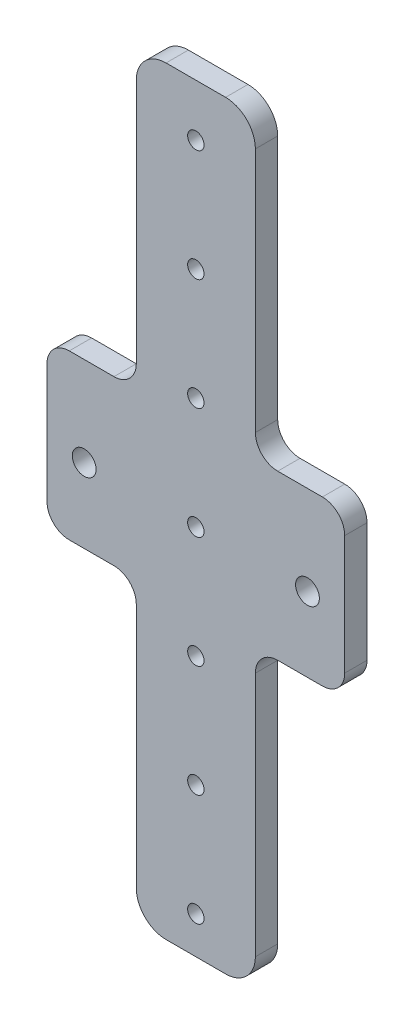
ISO-10303-21;
HEADER;
FILE_DESCRIPTION(('STEP AP214'),'2;1');
FILE_NAME('part.step','',(''),(''),'','','');
FILE_SCHEMA(('AUTOMOTIVE_DESIGN { 1 0 10303 214 1 1 1 1 }'));
ENDSEC;
DATA;
#1=APPLICATION_CONTEXT('core data for automotive mechanical design processes');
#2=APPLICATION_PROTOCOL_DEFINITION('international standard','automotive_design',2000,#1);
#3=PRODUCT_CONTEXT('',#1,'mechanical');
#4=PRODUCT('Part','Part','',(#3));
#5=PRODUCT_RELATED_PRODUCT_CATEGORY('part','',(#4));
#6=PRODUCT_DEFINITION_FORMATION('','',#4);
#7=PRODUCT_DEFINITION_CONTEXT('part definition',#1,'design');
#8=PRODUCT_DEFINITION('design','',#6,#7);
#9=PRODUCT_DEFINITION_SHAPE('','',#8);
#10=(LENGTH_UNIT() NAMED_UNIT(*) SI_UNIT(.MILLI.,.METRE.));
#11=(NAMED_UNIT(*) PLANE_ANGLE_UNIT() SI_UNIT($,.RADIAN.));
#12=(NAMED_UNIT(*) SI_UNIT($,.STERADIAN.) SOLID_ANGLE_UNIT());
#13=UNCERTAINTY_MEASURE_WITH_UNIT(LENGTH_MEASURE(1.E-05),#10,'distance_accuracy_value','');
#14=(GEOMETRIC_REPRESENTATION_CONTEXT(3) GLOBAL_UNCERTAINTY_ASSIGNED_CONTEXT((#13)) GLOBAL_UNIT_ASSIGNED_CONTEXT((#10,
#11,#12)) REPRESENTATION_CONTEXT('',''));
#15=CARTESIAN_POINT('',(0.,0.,0.));
#16=DIRECTION('',(0.,0.,1.));
#17=DIRECTION('',(1.,0.,0.));
#18=AXIS2_PLACEMENT_3D('',#15,#16,#17);
#19=CARTESIAN_POINT('',(0.,0.,3.));
#20=DIRECTION('',(0.,0.,-1.));
#21=DIRECTION('',(-1.,0.,0.));
#22=AXIS2_PLACEMENT_3D('',#19,#20,#21);
#23=PLANE('',#22);
#24=CARTESIAN_POINT('',(0.,15.,3.));
#25=DIRECTION('',(0.,0.,1.));
#26=DIRECTION('',(1.,0.,0.));
#27=AXIS2_PLACEMENT_3D('',#24,#25,#26);
#28=CIRCLE('',#27,1.1);
#29=CARTESIAN_POINT('',(1.09999999999995,15.,3.));
#30=VERTEX_POINT('',#29);
#31=EDGE_CURVE('E408',#30,#30,#28,.T.);
#32=ORIENTED_EDGE('',*,*,#31,.F.);
#33=EDGE_LOOP('',(#32));
#34=FACE_BOUND('',#33,.T.);
#35=CARTESIAN_POINT('',(0.,-15.,3.));
#36=DIRECTION('',(0.,0.,1.));
#37=DIRECTION('',(1.,0.,0.));
#38=AXIS2_PLACEMENT_3D('',#35,#36,#37);
#39=CIRCLE('',#38,1.1000000000002);
#40=CARTESIAN_POINT('',(1.10000000000025,-15.,3.));
#41=VERTEX_POINT('',#40);
#42=EDGE_CURVE('E402',#41,#41,#39,.T.);
#43=ORIENTED_EDGE('',*,*,#42,.F.);
#44=EDGE_LOOP('',(#43));
#45=FACE_BOUND('',#44,.T.);
#46=CARTESIAN_POINT('',(-1.04744440165294E-13,30.,3.));
#47=DIRECTION('',(0.,0.,1.));
#48=DIRECTION('',(1.,0.,0.));
#49=AXIS2_PLACEMENT_3D('',#46,#47,#48);
#50=CIRCLE('',#49,1.1);
#51=CARTESIAN_POINT('',(1.0999999999999,30.,3.));
#52=VERTEX_POINT('',#51);
#53=EDGE_CURVE('E396',#52,#52,#50,.T.);
#54=ORIENTED_EDGE('',*,*,#53,.F.);
#55=EDGE_LOOP('',(#54));
#56=FACE_BOUND('',#55,.T.);
#57=CARTESIAN_POINT('',(-1.57116660247941E-13,45.,3.));
#58=DIRECTION('',(0.,0.,1.));
#59=DIRECTION('',(1.,0.,0.));
#60=AXIS2_PLACEMENT_3D('',#57,#58,#59);
#61=CIRCLE('',#60,1.1);
#62=CARTESIAN_POINT('',(1.09999999999984,45.,3.));
#63=VERTEX_POINT('',#62);
#64=EDGE_CURVE('E389',#63,#63,#61,.T.);
#65=ORIENTED_EDGE('',*,*,#64,.F.);
#66=EDGE_LOOP('',(#65));
#67=FACE_BOUND('',#66,.T.);
#68=CARTESIAN_POINT('',(0.,0.,3.));
#69=DIRECTION('',(0.,0.,1.));
#70=DIRECTION('',(1.,0.,0.));
#71=AXIS2_PLACEMENT_3D('',#68,#69,#70);
#72=CIRCLE('',#71,1.1);
#73=CARTESIAN_POINT('',(1.1,0.,3.));
#74=VERTEX_POINT('',#73);
#75=EDGE_CURVE('E426',#74,#74,#72,.T.);
#76=ORIENTED_EDGE('',*,*,#75,.F.);
#77=EDGE_LOOP('',(#76));
#78=FACE_BOUND('',#77,.T.);
#79=CARTESIAN_POINT('',(4.18977760661176E-13,-30.,3.));
#80=DIRECTION('',(0.,0.,1.));
#81=DIRECTION('',(1.,0.,0.));
#82=AXIS2_PLACEMENT_3D('',#79,#80,#81);
#83=CIRCLE('',#82,1.1);
#84=CARTESIAN_POINT('',(1.10000000000042,-30.,3.));
#85=VERTEX_POINT('',#84);
#86=EDGE_CURVE('E420',#85,#85,#83,.T.);
#87=ORIENTED_EDGE('',*,*,#86,.F.);
#88=EDGE_LOOP('',(#87));
#89=FACE_BOUND('',#88,.T.);
#90=CARTESIAN_POINT('',(5.76094420909117E-13,-45.,3.));
#91=DIRECTION('',(0.,0.,1.));
#92=DIRECTION('',(1.,0.,0.));
#93=AXIS2_PLACEMENT_3D('',#90,#91,#92);
#94=CIRCLE('',#93,1.1);
#95=CARTESIAN_POINT('',(1.10000000000058,-45.,3.));
#96=VERTEX_POINT('',#95);
#97=EDGE_CURVE('E413',#96,#96,#94,.T.);
#98=ORIENTED_EDGE('',*,*,#97,.F.);
#99=EDGE_LOOP('',(#98));
#100=FACE_BOUND('',#99,.T.);
#101=DIRECTION('',(0.,1.,0.));
#102=VECTOR('',#101,1.);
#103=CARTESIAN_POINT('',(-8.,-10.,3.));
#104=LINE('',#103,#102);
#105=CARTESIAN_POINT('',(-8.,-46.,3.));
#106=VERTEX_POINT('',#105);
#107=CARTESIAN_POINT('',(-8.,-13.,3.));
#108=VERTEX_POINT('',#107);
#109=EDGE_CURVE('E469',#106,#108,#104,.T.);
#110=ORIENTED_EDGE('',*,*,#109,.F.);
#111=CARTESIAN_POINT('',(-4.,-46.,3.));
#112=DIRECTION('',(0.,0.,-1.));
#113=DIRECTION('',(-1.,0.,0.));
#114=AXIS2_PLACEMENT_3D('',#111,#112,#113);
#115=CIRCLE('',#114,4.);
#116=CARTESIAN_POINT('',(-4.,-50.,3.));
#117=VERTEX_POINT('',#116);
#118=EDGE_CURVE('E312',#106,#117,#115,.F.);
#119=ORIENTED_EDGE('',*,*,#118,.T.);
#120=DIRECTION('',(-1.,0.,0.));
#121=VECTOR('',#120,1.);
#122=CARTESIAN_POINT('',(8.00000000000004,-50.,3.));
#123=LINE('',#122,#121);
#124=CARTESIAN_POINT('',(4.00000000000004,-50.,3.));
#125=VERTEX_POINT('',#124);
#126=EDGE_CURVE('E491',#125,#117,#123,.T.);
#127=ORIENTED_EDGE('',*,*,#126,.F.);
#128=CARTESIAN_POINT('',(4.00000000000004,-46.,3.));
#129=DIRECTION('',(0.,0.,-1.));
#130=DIRECTION('',(-1.,0.,0.));
#131=AXIS2_PLACEMENT_3D('',#128,#129,#130);
#132=CIRCLE('',#131,4.);
#133=CARTESIAN_POINT('',(8.00000000000004,-46.,3.));
#134=VERTEX_POINT('',#133);
#135=EDGE_CURVE('E310',#125,#134,#132,.F.);
#136=ORIENTED_EDGE('',*,*,#135,.T.);
#137=DIRECTION('',(0.,-1.,0.));
#138=VECTOR('',#137,1.);
#139=CARTESIAN_POINT('',(8.00000000000004,-10.,3.));
#140=LINE('',#139,#138);
#141=CARTESIAN_POINT('',(8.00000000000004,-13.,3.));
#142=VERTEX_POINT('',#141);
#143=EDGE_CURVE('E364',#142,#134,#140,.T.);
#144=ORIENTED_EDGE('',*,*,#143,.F.);
#145=CARTESIAN_POINT('',(11.,-13.,3.));
#146=DIRECTION('',(0.,0.,-1.));
#147=DIRECTION('',(-1.,0.,0.));
#148=AXIS2_PLACEMENT_3D('',#145,#146,#147);
#149=CIRCLE('',#148,3.);
#150=CARTESIAN_POINT('',(11.,-10.,3.));
#151=VERTEX_POINT('',#150);
#152=EDGE_CURVE('E284',#142,#151,#149,.T.);
#153=ORIENTED_EDGE('',*,*,#152,.T.);
#154=DIRECTION('',(-1.,0.,0.));
#155=VECTOR('',#154,1.);
#156=CARTESIAN_POINT('',(20.,-9.99999999999999,3.));
#157=LINE('',#156,#155);
#158=CARTESIAN_POINT('',(17.,-10.,3.));
#159=VERTEX_POINT('',#158);
#160=EDGE_CURVE('E361',#159,#151,#157,.T.);
#161=ORIENTED_EDGE('',*,*,#160,.F.);
#162=CARTESIAN_POINT('',(17.,-7.,3.));
#163=DIRECTION('',(0.,0.,-1.));
#164=DIRECTION('',(-1.,0.,0.));
#165=AXIS2_PLACEMENT_3D('',#162,#163,#164);
#166=CIRCLE('',#165,3.);
#167=CARTESIAN_POINT('',(20.,-6.99999999999999,3.));
#168=VERTEX_POINT('',#167);
#169=EDGE_CURVE('E251',#159,#168,#166,.F.);
#170=ORIENTED_EDGE('',*,*,#169,.T.);
#171=DIRECTION('',(0.,1.,0.));
#172=VECTOR('',#171,1.);
#173=CARTESIAN_POINT('',(20.,-75.,3.));
#174=LINE('',#173,#172);
#175=CARTESIAN_POINT('',(20.,8.99999999999999,3.));
#176=VERTEX_POINT('',#175);
#177=EDGE_CURVE('E443',#168,#176,#174,.T.);
#178=ORIENTED_EDGE('',*,*,#177,.T.);
#179=CARTESIAN_POINT('',(17.,8.99999999999999,3.));
#180=DIRECTION('',(0.,0.,-1.));
#181=DIRECTION('',(-1.,0.,0.));
#182=AXIS2_PLACEMENT_3D('',#179,#180,#181);
#183=CIRCLE('',#182,3.);
#184=CARTESIAN_POINT('',(17.,12.,3.));
#185=VERTEX_POINT('',#184);
#186=EDGE_CURVE('E249',#176,#185,#183,.F.);
#187=ORIENTED_EDGE('',*,*,#186,.T.);
#188=DIRECTION('',(1.,0.,0.));
#189=VECTOR('',#188,1.);
#190=CARTESIAN_POINT('',(20.,12.,3.));
#191=LINE('',#190,#189);
#192=CARTESIAN_POINT('',(11.,12.,3.));
#193=VERTEX_POINT('',#192);
#194=EDGE_CURVE('E212',#193,#185,#191,.T.);
#195=ORIENTED_EDGE('',*,*,#194,.F.);
#196=CARTESIAN_POINT('',(11.,15.,3.));
#197=DIRECTION('',(0.,0.,-1.));
#198=DIRECTION('',(-1.,0.,0.));
#199=AXIS2_PLACEMENT_3D('',#196,#197,#198);
#200=CIRCLE('',#199,3.);
#201=CARTESIAN_POINT('',(8.00000000000003,15.,3.));
#202=VERTEX_POINT('',#201);
#203=EDGE_CURVE('E289',#193,#202,#200,.T.);
#204=ORIENTED_EDGE('',*,*,#203,.T.);
#205=DIRECTION('',(0.,-1.,0.));
#206=VECTOR('',#205,1.);
#207=CARTESIAN_POINT('',(8.00000000000003,12.,3.));
#208=LINE('',#207,#206);
#209=CARTESIAN_POINT('',(8.00000000000002,48.,3.));
#210=VERTEX_POINT('',#209);
#211=EDGE_CURVE('E347',#210,#202,#208,.T.);
#212=ORIENTED_EDGE('',*,*,#211,.F.);
#213=CARTESIAN_POINT('',(4.00000000000002,48.,3.));
#214=DIRECTION('',(0.,0.,-1.));
#215=DIRECTION('',(-1.,0.,0.));
#216=AXIS2_PLACEMENT_3D('',#213,#214,#215);
#217=CIRCLE('',#216,4.);
#218=CARTESIAN_POINT('',(4.00000000000002,52.,3.));
#219=VERTEX_POINT('',#218);
#220=EDGE_CURVE('E308',#210,#219,#217,.F.);
#221=ORIENTED_EDGE('',*,*,#220,.T.);
#222=DIRECTION('',(1.,0.,0.));
#223=VECTOR('',#222,1.);
#224=CARTESIAN_POINT('',(8.00000000000002,52.,3.));
#225=LINE('',#224,#223);
#226=CARTESIAN_POINT('',(-4.00000000000001,52.,3.));
#227=VERTEX_POINT('',#226);
#228=EDGE_CURVE('E342',#227,#219,#225,.T.);
#229=ORIENTED_EDGE('',*,*,#228,.F.);
#230=CARTESIAN_POINT('',(-4.00000000000001,48.,3.));
#231=DIRECTION('',(0.,0.,-1.));
#232=DIRECTION('',(-1.,0.,0.));
#233=AXIS2_PLACEMENT_3D('',#230,#231,#232);
#234=CIRCLE('',#233,4.);
#235=CARTESIAN_POINT('',(-8.00000000000001,48.,3.));
#236=VERTEX_POINT('',#235);
#237=EDGE_CURVE('E306',#227,#236,#234,.F.);
#238=ORIENTED_EDGE('',*,*,#237,.T.);
#239=DIRECTION('',(0.,1.,0.));
#240=VECTOR('',#239,1.);
#241=CARTESIAN_POINT('',(-8.00000000000001,12.,3.));
#242=LINE('',#241,#240);
#243=CARTESIAN_POINT('',(-8.00000000000001,15.,3.));
#244=VERTEX_POINT('',#243);
#245=EDGE_CURVE('E370',#244,#236,#242,.T.);
#246=ORIENTED_EDGE('',*,*,#245,.F.);
#247=CARTESIAN_POINT('',(-11.,15.,3.));
#248=DIRECTION('',(0.,0.,-1.));
#249=DIRECTION('',(-1.,0.,0.));
#250=AXIS2_PLACEMENT_3D('',#247,#248,#249);
#251=CIRCLE('',#250,3.);
#252=CARTESIAN_POINT('',(-11.,12.,3.));
#253=VERTEX_POINT('',#252);
#254=EDGE_CURVE('E293',#244,#253,#251,.T.);
#255=ORIENTED_EDGE('',*,*,#254,.T.);
#256=DIRECTION('',(1.,0.,0.));
#257=VECTOR('',#256,1.);
#258=CARTESIAN_POINT('',(-20.,12.,3.));
#259=LINE('',#258,#257);
#260=CARTESIAN_POINT('',(-17.,12.,3.));
#261=VERTEX_POINT('',#260);
#262=EDGE_CURVE('E367',#261,#253,#259,.T.);
#263=ORIENTED_EDGE('',*,*,#262,.F.);
#264=CARTESIAN_POINT('',(-17.,9.,3.));
#265=DIRECTION('',(0.,0.,-1.));
#266=DIRECTION('',(-1.,0.,0.));
#267=AXIS2_PLACEMENT_3D('',#264,#265,#266);
#268=CIRCLE('',#267,3.);
#269=CARTESIAN_POINT('',(-20.,8.99999999999999,3.));
#270=VERTEX_POINT('',#269);
#271=EDGE_CURVE('E247',#261,#270,#268,.F.);
#272=ORIENTED_EDGE('',*,*,#271,.T.);
#273=DIRECTION('',(0.,-1.,0.));
#274=VECTOR('',#273,1.);
#275=CARTESIAN_POINT('',(-20.,-75.,3.));
#276=LINE('',#275,#274);
#277=CARTESIAN_POINT('',(-20.,-6.99999999999999,3.));
#278=VERTEX_POINT('',#277);
#279=EDGE_CURVE('E446',#270,#278,#276,.T.);
#280=ORIENTED_EDGE('',*,*,#279,.T.);
#281=CARTESIAN_POINT('',(-17.,-6.99999999999999,3.));
#282=DIRECTION('',(0.,0.,-1.));
#283=DIRECTION('',(-1.,0.,0.));
#284=AXIS2_PLACEMENT_3D('',#281,#282,#283);
#285=CIRCLE('',#284,3.);
#286=CARTESIAN_POINT('',(-17.,-10.,3.));
#287=VERTEX_POINT('',#286);
#288=EDGE_CURVE('E245',#278,#287,#285,.F.);
#289=ORIENTED_EDGE('',*,*,#288,.T.);
#290=DIRECTION('',(-1.,0.,0.));
#291=VECTOR('',#290,1.);
#292=CARTESIAN_POINT('',(-20.,-9.99999999999999,3.));
#293=LINE('',#292,#291);
#294=CARTESIAN_POINT('',(-11.,-10.,3.));
#295=VERTEX_POINT('',#294);
#296=EDGE_CURVE('E371',#295,#287,#293,.T.);
#297=ORIENTED_EDGE('',*,*,#296,.F.);
#298=CARTESIAN_POINT('',(-11.,-13.,3.));
#299=DIRECTION('',(0.,0.,-1.));
#300=DIRECTION('',(-1.,0.,0.));
#301=AXIS2_PLACEMENT_3D('',#298,#299,#300);
#302=CIRCLE('',#301,3.);
#303=EDGE_CURVE('E298',#295,#108,#302,.T.);
#304=ORIENTED_EDGE('',*,*,#303,.T.);
#305=EDGE_LOOP('',(#110,#119,#127,#136,#144,#153,#161,#170,#178,#187,#195,#204,#212,#221,#229,
#238,#246,#255,#263,#272,#280,#289,#297,#304));
#306=FACE_BOUND('',#305,.T.);
#307=CARTESIAN_POINT('',(-15.,0.,3.));
#308=DIRECTION('',(0.,0.,1.));
#309=DIRECTION('',(1.,0.,0.));
#310=AXIS2_PLACEMENT_3D('',#307,#308,#309);
#311=CIRCLE('',#310,1.6);
#312=CARTESIAN_POINT('',(-13.4,0.,3.));
#313=VERTEX_POINT('',#312);
#314=EDGE_CURVE('E437',#313,#313,#311,.T.);
#315=ORIENTED_EDGE('',*,*,#314,.F.);
#316=EDGE_LOOP('',(#315));
#317=FACE_BOUND('',#316,.T.);
#318=CARTESIAN_POINT('',(15.,0.,3.));
#319=DIRECTION('',(0.,0.,1.));
#320=DIRECTION('',(-1.,0.,0.));
#321=AXIS2_PLACEMENT_3D('',#318,#319,#320);
#322=CIRCLE('',#321,1.6);
#323=CARTESIAN_POINT('',(13.4,0.,3.));
#324=VERTEX_POINT('',#323);
#325=EDGE_CURVE('E431',#324,#324,#322,.T.);
#326=ORIENTED_EDGE('',*,*,#325,.F.);
#327=EDGE_LOOP('',(#326));
#328=FACE_BOUND('',#327,.T.);
#329=ADVANCED_FACE('F43',(#34,#45,#56,#67,#78,#89,#100,#306,#317,#328),#23,.F.);
#330=CARTESIAN_POINT('',(0.,0.,0.));
#331=DIRECTION('',(0.,0.,-1.));
#332=DIRECTION('',(-1.,0.,0.));
#333=AXIS2_PLACEMENT_3D('',#330,#331,#332);
#334=PLANE('',#333);
#335=DIRECTION('',(1.,0.,0.));
#336=VECTOR('',#335,1.);
#337=CARTESIAN_POINT('',(0.,-50.,0.));
#338=LINE('',#337,#336);
#339=CARTESIAN_POINT('',(-4.,-50.,0.));
#340=VERTEX_POINT('',#339);
#341=CARTESIAN_POINT('',(4.00000000000004,-50.,0.));
#342=VERTEX_POINT('',#341);
#343=EDGE_CURVE('E348',#340,#342,#338,.T.);
#344=ORIENTED_EDGE('',*,*,#343,.F.);
#345=CARTESIAN_POINT('',(-4.,-46.,0.));
#346=DIRECTION('',(0.,0.,-1.));
#347=DIRECTION('',(-1.,0.,0.));
#348=AXIS2_PLACEMENT_3D('',#345,#346,#347);
#349=CIRCLE('',#348,4.);
#350=CARTESIAN_POINT('',(-8.,-46.,0.));
#351=VERTEX_POINT('',#350);
#352=EDGE_CURVE('E325',#340,#351,#349,.T.);
#353=ORIENTED_EDGE('',*,*,#352,.T.);
#354=DIRECTION('',(0.,-1.,0.));
#355=VECTOR('',#354,1.);
#356=CARTESIAN_POINT('',(-8.00000000000001,0.,0.));
#357=LINE('',#356,#355);
#358=CARTESIAN_POINT('',(-8.,-13.,0.));
#359=VERTEX_POINT('',#358);
#360=EDGE_CURVE('E376',#359,#351,#357,.T.);
#361=ORIENTED_EDGE('',*,*,#360,.F.);
#362=CARTESIAN_POINT('',(-11.,-13.,0.));
#363=DIRECTION('',(0.,0.,-1.));
#364=DIRECTION('',(-1.,0.,0.));
#365=AXIS2_PLACEMENT_3D('',#362,#363,#364);
#366=CIRCLE('',#365,3.);
#367=CARTESIAN_POINT('',(-11.,-10.,0.));
#368=VERTEX_POINT('',#367);
#369=EDGE_CURVE('E301',#359,#368,#366,.F.);
#370=ORIENTED_EDGE('',*,*,#369,.T.);
#371=DIRECTION('',(1.,0.,0.));
#372=VECTOR('',#371,1.);
#373=CARTESIAN_POINT('',(0.,-10.,0.));
#374=LINE('',#373,#372);
#375=CARTESIAN_POINT('',(-17.,-10.,0.));
#376=VERTEX_POINT('',#375);
#377=EDGE_CURVE('E384',#376,#368,#374,.T.);
#378=ORIENTED_EDGE('',*,*,#377,.F.);
#379=CARTESIAN_POINT('',(-17.,-6.99999999999999,0.));
#380=DIRECTION('',(0.,0.,-1.));
#381=DIRECTION('',(-1.,0.,0.));
#382=AXIS2_PLACEMENT_3D('',#379,#380,#381);
#383=CIRCLE('',#382,3.);
#384=CARTESIAN_POINT('',(-20.,-6.99999999999999,0.));
#385=VERTEX_POINT('',#384);
#386=EDGE_CURVE('E240',#376,#385,#383,.T.);
#387=ORIENTED_EDGE('',*,*,#386,.T.);
#388=DIRECTION('',(0.,-1.,0.));
#389=VECTOR('',#388,1.);
#390=CARTESIAN_POINT('',(-20.,-75.,0.));
#391=LINE('',#390,#389);
#392=CARTESIAN_POINT('',(-20.,8.99999999999999,0.));
#393=VERTEX_POINT('',#392);
#394=EDGE_CURVE('E447',#393,#385,#391,.T.);
#395=ORIENTED_EDGE('',*,*,#394,.F.);
#396=CARTESIAN_POINT('',(-17.,9.,0.));
#397=DIRECTION('',(0.,0.,-1.));
#398=DIRECTION('',(-1.,0.,0.));
#399=AXIS2_PLACEMENT_3D('',#396,#397,#398);
#400=CIRCLE('',#399,3.);
#401=CARTESIAN_POINT('',(-17.,12.,0.));
#402=VERTEX_POINT('',#401);
#403=EDGE_CURVE('E236',#393,#402,#400,.T.);
#404=ORIENTED_EDGE('',*,*,#403,.T.);
#405=DIRECTION('',(-1.,0.,0.));
#406=VECTOR('',#405,1.);
#407=CARTESIAN_POINT('',(0.,12.,0.));
#408=LINE('',#407,#406);
#409=CARTESIAN_POINT('',(-11.,12.,0.));
#410=VERTEX_POINT('',#409);
#411=EDGE_CURVE('E381',#410,#402,#408,.T.);
#412=ORIENTED_EDGE('',*,*,#411,.F.);
#413=CARTESIAN_POINT('',(-11.,15.,0.));
#414=DIRECTION('',(0.,0.,-1.));
#415=DIRECTION('',(-1.,0.,0.));
#416=AXIS2_PLACEMENT_3D('',#413,#414,#415);
#417=CIRCLE('',#416,3.);
#418=CARTESIAN_POINT('',(-8.00000000000001,15.,0.));
#419=VERTEX_POINT('',#418);
#420=EDGE_CURVE('E295',#410,#419,#417,.F.);
#421=ORIENTED_EDGE('',*,*,#420,.T.);
#422=DIRECTION('',(0.,-1.,0.));
#423=VECTOR('',#422,1.);
#424=CARTESIAN_POINT('',(-8.00000000000001,0.,0.));
#425=LINE('',#424,#423);
#426=CARTESIAN_POINT('',(-8.00000000000001,48.,0.));
#427=VERTEX_POINT('',#426);
#428=EDGE_CURVE('E373',#427,#419,#425,.T.);
#429=ORIENTED_EDGE('',*,*,#428,.F.);
#430=CARTESIAN_POINT('',(-4.00000000000001,48.,0.));
#431=DIRECTION('',(0.,0.,-1.));
#432=DIRECTION('',(-1.,0.,0.));
#433=AXIS2_PLACEMENT_3D('',#430,#431,#432);
#434=CIRCLE('',#433,4.);
#435=CARTESIAN_POINT('',(-4.00000000000001,52.,0.));
#436=VERTEX_POINT('',#435);
#437=EDGE_CURVE('E319',#427,#436,#434,.T.);
#438=ORIENTED_EDGE('',*,*,#437,.T.);
#439=DIRECTION('',(-1.,0.,0.));
#440=VECTOR('',#439,1.);
#441=CARTESIAN_POINT('',(0.,52.,0.));
#442=LINE('',#441,#440);
#443=CARTESIAN_POINT('',(4.00000000000002,52.,0.));
#444=VERTEX_POINT('',#443);
#445=EDGE_CURVE('E339',#444,#436,#442,.T.);
#446=ORIENTED_EDGE('',*,*,#445,.F.);
#447=CARTESIAN_POINT('',(4.00000000000002,48.,0.));
#448=DIRECTION('',(0.,0.,-1.));
#449=DIRECTION('',(-1.,0.,0.));
#450=AXIS2_PLACEMENT_3D('',#447,#448,#449);
#451=CIRCLE('',#450,4.);
#452=CARTESIAN_POINT('',(8.00000000000002,48.,0.));
#453=VERTEX_POINT('',#452);
#454=EDGE_CURVE('E321',#444,#453,#451,.T.);
#455=ORIENTED_EDGE('',*,*,#454,.T.);
#456=DIRECTION('',(0.,1.,0.));
#457=VECTOR('',#456,1.);
#458=CARTESIAN_POINT('',(8.00000000000003,0.,0.));
#459=LINE('',#458,#457);
#460=CARTESIAN_POINT('',(8.00000000000003,15.,0.));
#461=VERTEX_POINT('',#460);
#462=EDGE_CURVE('E355',#461,#453,#459,.T.);
#463=ORIENTED_EDGE('',*,*,#462,.F.);
#464=CARTESIAN_POINT('',(11.,15.,0.));
#465=DIRECTION('',(0.,0.,-1.));
#466=DIRECTION('',(-1.,0.,0.));
#467=AXIS2_PLACEMENT_3D('',#464,#465,#466);
#468=CIRCLE('',#467,3.);
#469=CARTESIAN_POINT('',(11.,12.,0.));
#470=VERTEX_POINT('',#469);
#471=EDGE_CURVE('E227',#461,#470,#468,.F.);
#472=ORIENTED_EDGE('',*,*,#471,.T.);
#473=DIRECTION('',(-1.,0.,0.));
#474=VECTOR('',#473,1.);
#475=CARTESIAN_POINT('',(0.,12.,0.));
#476=LINE('',#475,#474);
#477=CARTESIAN_POINT('',(17.,12.,0.));
#478=VERTEX_POINT('',#477);
#479=EDGE_CURVE('E209',#478,#470,#476,.T.);
#480=ORIENTED_EDGE('',*,*,#479,.F.);
#481=CARTESIAN_POINT('',(17.,8.99999999999999,0.));
#482=DIRECTION('',(0.,0.,-1.));
#483=DIRECTION('',(-1.,0.,0.));
#484=AXIS2_PLACEMENT_3D('',#481,#482,#483);
#485=CIRCLE('',#484,3.);
#486=CARTESIAN_POINT('',(20.,8.99999999999999,0.));
#487=VERTEX_POINT('',#486);
#488=EDGE_CURVE('E223',#478,#487,#485,.T.);
#489=ORIENTED_EDGE('',*,*,#488,.T.);
#490=DIRECTION('',(0.,1.,0.));
#491=VECTOR('',#490,1.);
#492=CARTESIAN_POINT('',(20.,-75.,0.));
#493=LINE('',#492,#491);
#494=CARTESIAN_POINT('',(20.,-6.99999999999999,0.));
#495=VERTEX_POINT('',#494);
#496=EDGE_CURVE('E440',#495,#487,#493,.T.);
#497=ORIENTED_EDGE('',*,*,#496,.F.);
#498=CARTESIAN_POINT('',(17.,-7.,0.));
#499=DIRECTION('',(0.,0.,-1.));
#500=DIRECTION('',(-1.,0.,0.));
#501=AXIS2_PLACEMENT_3D('',#498,#499,#500);
#502=CIRCLE('',#501,3.);
#503=CARTESIAN_POINT('',(17.,-9.99999999999999,0.));
#504=VERTEX_POINT('',#503);
#505=EDGE_CURVE('E235',#495,#504,#502,.T.);
#506=ORIENTED_EDGE('',*,*,#505,.T.);
#507=DIRECTION('',(1.,0.,0.));
#508=VECTOR('',#507,1.);
#509=CARTESIAN_POINT('',(0.,-10.,0.));
#510=LINE('',#509,#508);
#511=CARTESIAN_POINT('',(11.,-10.,0.));
#512=VERTEX_POINT('',#511);
#513=EDGE_CURVE('E229',#512,#504,#510,.T.);
#514=ORIENTED_EDGE('',*,*,#513,.F.);
#515=CARTESIAN_POINT('',(11.,-13.,0.));
#516=DIRECTION('',(0.,0.,-1.));
#517=DIRECTION('',(-1.,0.,0.));
#518=AXIS2_PLACEMENT_3D('',#515,#516,#517);
#519=CIRCLE('',#518,3.);
#520=CARTESIAN_POINT('',(8.00000000000004,-13.,0.));
#521=VERTEX_POINT('',#520);
#522=EDGE_CURVE('E286',#512,#521,#519,.F.);
#523=ORIENTED_EDGE('',*,*,#522,.T.);
#524=DIRECTION('',(0.,1.,0.));
#525=VECTOR('',#524,1.);
#526=CARTESIAN_POINT('',(8.00000000000004,0.,0.));
#527=LINE('',#526,#525);
#528=CARTESIAN_POINT('',(8.00000000000004,-46.,0.));
#529=VERTEX_POINT('',#528);
#530=EDGE_CURVE('E379',#529,#521,#527,.T.);
#531=ORIENTED_EDGE('',*,*,#530,.F.);
#532=CARTESIAN_POINT('',(4.00000000000004,-46.,0.));
#533=DIRECTION('',(0.,0.,-1.));
#534=DIRECTION('',(-1.,0.,0.));
#535=AXIS2_PLACEMENT_3D('',#532,#533,#534);
#536=CIRCLE('',#535,4.);
#537=EDGE_CURVE('E323',#529,#342,#536,.T.);
#538=ORIENTED_EDGE('',*,*,#537,.T.);
#539=EDGE_LOOP('',(#344,#353,#361,#370,#378,#387,#395,#404,#412,#421,#429,#438,#446,#455,#463,
#472,#480,#489,#497,#506,#514,#523,#531,#538));
#540=FACE_BOUND('',#539,.T.);
#541=CARTESIAN_POINT('',(0.,15.,0.));
#542=DIRECTION('',(0.,0.,1.));
#543=DIRECTION('',(1.,0.,0.));
#544=AXIS2_PLACEMENT_3D('',#541,#542,#543);
#545=CIRCLE('',#544,1.1);
#546=CARTESIAN_POINT('',(1.09999999999995,15.,0.));
#547=VERTEX_POINT('',#546);
#548=EDGE_CURVE('E228',#547,#547,#545,.T.);
#549=ORIENTED_EDGE('',*,*,#548,.T.);
#550=EDGE_LOOP('',(#549));
#551=FACE_BOUND('',#550,.T.);
#552=CARTESIAN_POINT('',(0.,-15.,0.));
#553=DIRECTION('',(0.,0.,1.));
#554=DIRECTION('',(1.,0.,0.));
#555=AXIS2_PLACEMENT_3D('',#552,#553,#554);
#556=CIRCLE('',#555,1.1000000000002);
#557=CARTESIAN_POINT('',(1.10000000000025,-15.,0.));
#558=VERTEX_POINT('',#557);
#559=EDGE_CURVE('E405',#558,#558,#556,.T.);
#560=ORIENTED_EDGE('',*,*,#559,.T.);
#561=EDGE_LOOP('',(#560));
#562=FACE_BOUND('',#561,.T.);
#563=CARTESIAN_POINT('',(-1.04744440165294E-13,30.,0.));
#564=DIRECTION('',(0.,0.,1.));
#565=DIRECTION('',(1.,0.,0.));
#566=AXIS2_PLACEMENT_3D('',#563,#564,#565);
#567=CIRCLE('',#566,1.1);
#568=CARTESIAN_POINT('',(1.0999999999999,30.,0.));
#569=VERTEX_POINT('',#568);
#570=EDGE_CURVE('E399',#569,#569,#567,.T.);
#571=ORIENTED_EDGE('',*,*,#570,.T.);
#572=EDGE_LOOP('',(#571));
#573=FACE_BOUND('',#572,.T.);
#574=CARTESIAN_POINT('',(-1.57116660247941E-13,45.,0.));
#575=DIRECTION('',(0.,0.,1.));
#576=DIRECTION('',(1.,0.,0.));
#577=AXIS2_PLACEMENT_3D('',#574,#575,#576);
#578=CIRCLE('',#577,1.1);
#579=CARTESIAN_POINT('',(1.09999999999984,45.,0.));
#580=VERTEX_POINT('',#579);
#581=EDGE_CURVE('E393',#580,#580,#578,.T.);
#582=ORIENTED_EDGE('',*,*,#581,.T.);
#583=EDGE_LOOP('',(#582));
#584=FACE_BOUND('',#583,.T.);
#585=CARTESIAN_POINT('',(0.,0.,0.));
#586=DIRECTION('',(0.,0.,1.));
#587=DIRECTION('',(1.,0.,0.));
#588=AXIS2_PLACEMENT_3D('',#585,#586,#587);
#589=CIRCLE('',#588,1.1);
#590=CARTESIAN_POINT('',(1.1,0.,0.));
#591=VERTEX_POINT('',#590);
#592=EDGE_CURVE('E392',#591,#591,#589,.T.);
#593=ORIENTED_EDGE('',*,*,#592,.T.);
#594=EDGE_LOOP('',(#593));
#595=FACE_BOUND('',#594,.T.);
#596=CARTESIAN_POINT('',(4.18977760661176E-13,-30.,0.));
#597=DIRECTION('',(0.,0.,1.));
#598=DIRECTION('',(1.,0.,0.));
#599=AXIS2_PLACEMENT_3D('',#596,#597,#598);
#600=CIRCLE('',#599,1.1);
#601=CARTESIAN_POINT('',(1.10000000000042,-30.,0.));
#602=VERTEX_POINT('',#601);
#603=EDGE_CURVE('E423',#602,#602,#600,.T.);
#604=ORIENTED_EDGE('',*,*,#603,.T.);
#605=EDGE_LOOP('',(#604));
#606=FACE_BOUND('',#605,.T.);
#607=CARTESIAN_POINT('',(5.76094420909117E-13,-45.,0.));
#608=DIRECTION('',(0.,0.,1.));
#609=DIRECTION('',(1.,0.,0.));
#610=AXIS2_PLACEMENT_3D('',#607,#608,#609);
#611=CIRCLE('',#610,1.1);
#612=CARTESIAN_POINT('',(1.10000000000058,-45.,0.));
#613=VERTEX_POINT('',#612);
#614=EDGE_CURVE('E417',#613,#613,#611,.T.);
#615=ORIENTED_EDGE('',*,*,#614,.T.);
#616=EDGE_LOOP('',(#615));
#617=FACE_BOUND('',#616,.T.);
#618=CARTESIAN_POINT('',(-15.,0.,0.));
#619=DIRECTION('',(0.,0.,1.));
#620=DIRECTION('',(1.,0.,0.));
#621=AXIS2_PLACEMENT_3D('',#618,#619,#620);
#622=CIRCLE('',#621,1.6);
#623=CARTESIAN_POINT('',(-13.4,0.,0.));
#624=VERTEX_POINT('',#623);
#625=EDGE_CURVE('E434',#624,#624,#622,.T.);
#626=ORIENTED_EDGE('',*,*,#625,.T.);
#627=EDGE_LOOP('',(#626));
#628=FACE_BOUND('',#627,.T.);
#629=CARTESIAN_POINT('',(15.,0.,0.));
#630=DIRECTION('',(0.,0.,1.));
#631=DIRECTION('',(-1.,0.,0.));
#632=AXIS2_PLACEMENT_3D('',#629,#630,#631);
#633=CIRCLE('',#632,1.6);
#634=CARTESIAN_POINT('',(13.4,0.,0.));
#635=VERTEX_POINT('',#634);
#636=EDGE_CURVE('E416',#635,#635,#633,.T.);
#637=ORIENTED_EDGE('',*,*,#636,.T.);
#638=EDGE_LOOP('',(#637));
#639=FACE_BOUND('',#638,.T.);
#640=ADVANCED_FACE('F220',(#540,#551,#562,#573,#584,#595,#606,#617,#628,#639),#334,.T.);
#641=CARTESIAN_POINT('',(20.,-75.,3.));
#642=DIRECTION('',(-1.,0.,0.));
#643=DIRECTION('',(0.,0.,1.));
#644=AXIS2_PLACEMENT_3D('',#641,#642,#643);
#645=PLANE('',#644);
#646=ORIENTED_EDGE('',*,*,#177,.F.);
#647=DIRECTION('',(0.,0.,1.));
#648=VECTOR('',#647,1.);
#649=CARTESIAN_POINT('',(20.,-6.99999999999999,3.));
#650=LINE('',#649,#648);
#651=EDGE_CURVE('E262',#168,#495,#650,.F.);
#652=ORIENTED_EDGE('',*,*,#651,.T.);
#653=ORIENTED_EDGE('',*,*,#496,.T.);
#654=DIRECTION('',(0.,0.,1.));
#655=VECTOR('',#654,1.);
#656=CARTESIAN_POINT('',(20.,8.99999999999999,3.));
#657=LINE('',#656,#655);
#658=EDGE_CURVE('E234',#487,#176,#657,.T.);
#659=ORIENTED_EDGE('',*,*,#658,.T.);
#660=EDGE_LOOP('',(#646,#652,#653,#659));
#661=FACE_BOUND('',#660,.T.);
#662=ADVANCED_FACE('F520',(#661),#645,.F.);
#663=CARTESIAN_POINT('',(-20.,-75.,3.));
#664=DIRECTION('',(1.,0.,0.));
#665=DIRECTION('',(0.,0.,-1.));
#666=AXIS2_PLACEMENT_3D('',#663,#664,#665);
#667=PLANE('',#666);
#668=ORIENTED_EDGE('',*,*,#279,.F.);
#669=DIRECTION('',(0.,0.,1.));
#670=VECTOR('',#669,1.);
#671=CARTESIAN_POINT('',(-20.,8.99999999999999,3.));
#672=LINE('',#671,#670);
#673=EDGE_CURVE('E277',#270,#393,#672,.F.);
#674=ORIENTED_EDGE('',*,*,#673,.T.);
#675=ORIENTED_EDGE('',*,*,#394,.T.);
#676=DIRECTION('',(0.,0.,1.));
#677=VECTOR('',#676,1.);
#678=CARTESIAN_POINT('',(-20.,-6.99999999999999,3.));
#679=LINE('',#678,#677);
#680=EDGE_CURVE('E274',#385,#278,#679,.T.);
#681=ORIENTED_EDGE('',*,*,#680,.T.);
#682=EDGE_LOOP('',(#668,#674,#675,#681));
#683=FACE_BOUND('',#682,.T.);
#684=ADVANCED_FACE('F461',(#683),#667,.F.);
#685=CARTESIAN_POINT('',(-15.,0.,3.));
#686=DIRECTION('',(0.,0.,-1.));
#687=DIRECTION('',(-1.,0.,0.));
#688=AXIS2_PLACEMENT_3D('',#685,#686,#687);
#689=CYLINDRICAL_SURFACE('',#688,1.6);
#690=ORIENTED_EDGE('',*,*,#314,.T.);
#691=EDGE_LOOP('',(#690));
#692=FACE_BOUND('',#691,.T.);
#693=ORIENTED_EDGE('',*,*,#625,.F.);
#694=EDGE_LOOP('',(#693));
#695=FACE_BOUND('',#694,.T.);
#696=ADVANCED_FACE('F525',(#692,#695),#689,.F.);
#697=CARTESIAN_POINT('',(15.,0.,3.));
#698=DIRECTION('',(0.,0.,-1.));
#699=DIRECTION('',(-1.,0.,0.));
#700=AXIS2_PLACEMENT_3D('',#697,#698,#699);
#701=CYLINDRICAL_SURFACE('',#700,1.6);
#702=ORIENTED_EDGE('',*,*,#325,.T.);
#703=EDGE_LOOP('',(#702));
#704=FACE_BOUND('',#703,.T.);
#705=ORIENTED_EDGE('',*,*,#636,.F.);
#706=EDGE_LOOP('',(#705));
#707=FACE_BOUND('',#706,.T.);
#708=ADVANCED_FACE('F597',(#704,#707),#701,.F.);
#709=CARTESIAN_POINT('',(5.76094420909117E-13,-45.,0.));
#710=DIRECTION('',(0.,0.,1.));
#711=DIRECTION('',(1.,0.,0.));
#712=AXIS2_PLACEMENT_3D('',#709,#710,#711);
#713=CYLINDRICAL_SURFACE('',#712,1.1);
#714=ORIENTED_EDGE('',*,*,#614,.F.);
#715=EDGE_LOOP('',(#714));
#716=FACE_BOUND('',#715,.T.);
#717=ORIENTED_EDGE('',*,*,#97,.T.);
#718=EDGE_LOOP('',(#717));
#719=FACE_BOUND('',#718,.T.);
#720=ADVANCED_FACE('F593',(#716,#719),#713,.F.);
#721=CARTESIAN_POINT('',(4.18977760661176E-13,-30.,0.));
#722=DIRECTION('',(0.,0.,1.));
#723=DIRECTION('',(1.,0.,0.));
#724=AXIS2_PLACEMENT_3D('',#721,#722,#723);
#725=CYLINDRICAL_SURFACE('',#724,1.1);
#726=ORIENTED_EDGE('',*,*,#603,.F.);
#727=EDGE_LOOP('',(#726));
#728=FACE_BOUND('',#727,.T.);
#729=ORIENTED_EDGE('',*,*,#86,.T.);
#730=EDGE_LOOP('',(#729));
#731=FACE_BOUND('',#730,.T.);
#732=ADVANCED_FACE('F596',(#728,#731),#725,.F.);
#733=CARTESIAN_POINT('',(0.,0.,0.));
#734=DIRECTION('',(0.,0.,1.));
#735=DIRECTION('',(1.,0.,0.));
#736=AXIS2_PLACEMENT_3D('',#733,#734,#735);
#737=CYLINDRICAL_SURFACE('',#736,1.1);
#738=ORIENTED_EDGE('',*,*,#592,.F.);
#739=EDGE_LOOP('',(#738));
#740=FACE_BOUND('',#739,.T.);
#741=ORIENTED_EDGE('',*,*,#75,.T.);
#742=EDGE_LOOP('',(#741));
#743=FACE_BOUND('',#742,.T.);
#744=ADVANCED_FACE('F585',(#740,#743),#737,.F.);
#745=CARTESIAN_POINT('',(-1.57116660247941E-13,45.,0.));
#746=DIRECTION('',(0.,0.,1.));
#747=DIRECTION('',(1.,0.,0.));
#748=AXIS2_PLACEMENT_3D('',#745,#746,#747);
#749=CYLINDRICAL_SURFACE('',#748,1.1);
#750=ORIENTED_EDGE('',*,*,#581,.F.);
#751=EDGE_LOOP('',(#750));
#752=FACE_BOUND('',#751,.T.);
#753=ORIENTED_EDGE('',*,*,#64,.T.);
#754=EDGE_LOOP('',(#753));
#755=FACE_BOUND('',#754,.T.);
#756=ADVANCED_FACE('F581',(#752,#755),#749,.F.);
#757=CARTESIAN_POINT('',(-1.04744440165294E-13,30.,0.));
#758=DIRECTION('',(0.,0.,1.));
#759=DIRECTION('',(1.,0.,0.));
#760=AXIS2_PLACEMENT_3D('',#757,#758,#759);
#761=CYLINDRICAL_SURFACE('',#760,1.1);
#762=ORIENTED_EDGE('',*,*,#570,.F.);
#763=EDGE_LOOP('',(#762));
#764=FACE_BOUND('',#763,.T.);
#765=ORIENTED_EDGE('',*,*,#53,.T.);
#766=EDGE_LOOP('',(#765));
#767=FACE_BOUND('',#766,.T.);
#768=ADVANCED_FACE('F584',(#764,#767),#761,.F.);
#769=CARTESIAN_POINT('',(0.,-15.,0.));
#770=DIRECTION('',(0.,0.,1.));
#771=DIRECTION('',(1.,0.,0.));
#772=AXIS2_PLACEMENT_3D('',#769,#770,#771);
#773=CYLINDRICAL_SURFACE('',#772,1.1000000000002);
#774=ORIENTED_EDGE('',*,*,#559,.F.);
#775=EDGE_LOOP('',(#774));
#776=FACE_BOUND('',#775,.T.);
#777=ORIENTED_EDGE('',*,*,#42,.T.);
#778=EDGE_LOOP('',(#777));
#779=FACE_BOUND('',#778,.T.);
#780=ADVANCED_FACE('F575',(#776,#779),#773,.F.);
#781=CARTESIAN_POINT('',(0.,15.,0.));
#782=DIRECTION('',(0.,0.,1.));
#783=DIRECTION('',(1.,0.,0.));
#784=AXIS2_PLACEMENT_3D('',#781,#782,#783);
#785=CYLINDRICAL_SURFACE('',#784,1.1);
#786=ORIENTED_EDGE('',*,*,#31,.T.);
#787=EDGE_LOOP('',(#786));
#788=FACE_BOUND('',#787,.T.);
#789=ORIENTED_EDGE('',*,*,#548,.F.);
#790=EDGE_LOOP('',(#789));
#791=FACE_BOUND('',#790,.T.);
#792=ADVANCED_FACE('F568',(#788,#791),#785,.F.);
#793=CARTESIAN_POINT('',(-8.00000000000001,12.,-7.));
#794=DIRECTION('',(1.,0.,0.));
#795=DIRECTION('',(0.,1.,0.));
#796=AXIS2_PLACEMENT_3D('',#793,#794,#795);
#797=PLANE('',#796);
#798=ORIENTED_EDGE('',*,*,#245,.T.);
#799=DIRECTION('',(0.,0.,1.));
#800=VECTOR('',#799,1.);
#801=CARTESIAN_POINT('',(-8.00000000000001,48.,-7.));
#802=LINE('',#801,#800);
#803=EDGE_CURVE('E12',#236,#427,#802,.F.);
#804=ORIENTED_EDGE('',*,*,#803,.T.);
#805=ORIENTED_EDGE('',*,*,#428,.T.);
#806=DIRECTION('',(0.,0.,1.));
#807=VECTOR('',#806,1.);
#808=CARTESIAN_POINT('',(-8.00000000000001,15.,3.));
#809=LINE('',#808,#807);
#810=EDGE_CURVE('E266',#419,#244,#809,.T.);
#811=ORIENTED_EDGE('',*,*,#810,.T.);
#812=EDGE_LOOP('',(#798,#804,#805,#811));
#813=FACE_BOUND('',#812,.T.);
#814=ADVANCED_FACE('F566',(#813),#797,.F.);
#815=CARTESIAN_POINT('',(-20.,12.,-7.));
#816=DIRECTION('',(0.,-1.,0.));
#817=DIRECTION('',(1.,0.,0.));
#818=AXIS2_PLACEMENT_3D('',#815,#816,#817);
#819=PLANE('',#818);
#820=ORIENTED_EDGE('',*,*,#262,.T.);
#821=DIRECTION('',(0.,0.,1.));
#822=VECTOR('',#821,1.);
#823=CARTESIAN_POINT('',(-11.,12.,0.));
#824=LINE('',#823,#822);
#825=EDGE_CURVE('E272',#253,#410,#824,.F.);
#826=ORIENTED_EDGE('',*,*,#825,.T.);
#827=ORIENTED_EDGE('',*,*,#411,.T.);
#828=DIRECTION('',(0.,0.,1.));
#829=VECTOR('',#828,1.);
#830=CARTESIAN_POINT('',(-17.,12.,-7.));
#831=LINE('',#830,#829);
#832=EDGE_CURVE('E269',#402,#261,#831,.T.);
#833=ORIENTED_EDGE('',*,*,#832,.T.);
#834=EDGE_LOOP('',(#820,#826,#827,#833));
#835=FACE_BOUND('',#834,.T.);
#836=ADVANCED_FACE('F560',(#835),#819,.F.);
#837=CARTESIAN_POINT('',(20.,12.,-7.));
#838=DIRECTION('',(0.,-1.,0.));
#839=DIRECTION('',(1.,0.,0.));
#840=AXIS2_PLACEMENT_3D('',#837,#838,#839);
#841=PLANE('',#840);
#842=ORIENTED_EDGE('',*,*,#194,.T.);
#843=DIRECTION('',(0.,0.,1.));
#844=VECTOR('',#843,1.);
#845=CARTESIAN_POINT('',(17.,12.,-7.));
#846=LINE('',#845,#844);
#847=EDGE_CURVE('E205',#185,#478,#846,.F.);
#848=ORIENTED_EDGE('',*,*,#847,.T.);
#849=ORIENTED_EDGE('',*,*,#479,.T.);
#850=DIRECTION('',(0.,0.,1.));
#851=VECTOR('',#850,1.);
#852=CARTESIAN_POINT('',(11.,12.,3.));
#853=LINE('',#852,#851);
#854=EDGE_CURVE('E216',#470,#193,#853,.T.);
#855=ORIENTED_EDGE('',*,*,#854,.T.);
#856=EDGE_LOOP('',(#842,#848,#849,#855));
#857=FACE_BOUND('',#856,.T.);
#858=ADVANCED_FACE('F207',(#857),#841,.F.);
#859=CARTESIAN_POINT('',(8.00000000000003,12.,-7.));
#860=DIRECTION('',(-1.,0.,0.));
#861=DIRECTION('',(0.,-1.,0.));
#862=AXIS2_PLACEMENT_3D('',#859,#860,#861);
#863=PLANE('',#862);
#864=ORIENTED_EDGE('',*,*,#462,.T.);
#865=DIRECTION('',(0.,0.,1.));
#866=VECTOR('',#865,1.);
#867=CARTESIAN_POINT('',(8.00000000000002,48.,-7.));
#868=LINE('',#867,#866);
#869=EDGE_CURVE('E328',#453,#210,#868,.T.);
#870=ORIENTED_EDGE('',*,*,#869,.T.);
#871=ORIENTED_EDGE('',*,*,#211,.T.);
#872=DIRECTION('',(0.,0.,1.));
#873=VECTOR('',#872,1.);
#874=CARTESIAN_POINT('',(8.00000000000003,15.,0.));
#875=LINE('',#874,#873);
#876=EDGE_CURVE('E215',#202,#461,#875,.F.);
#877=ORIENTED_EDGE('',*,*,#876,.T.);
#878=EDGE_LOOP('',(#864,#870,#871,#877));
#879=FACE_BOUND('',#878,.T.);
#880=ADVANCED_FACE('F354',(#879),#863,.F.);
#881=CARTESIAN_POINT('',(-20.,-9.99999999999999,-7.));
#882=DIRECTION('',(0.,1.,0.));
#883=DIRECTION('',(-1.,0.,0.));
#884=AXIS2_PLACEMENT_3D('',#881,#882,#883);
#885=PLANE('',#884);
#886=ORIENTED_EDGE('',*,*,#296,.T.);
#887=DIRECTION('',(0.,0.,1.));
#888=VECTOR('',#887,1.);
#889=CARTESIAN_POINT('',(-17.,-10.,-7.));
#890=LINE('',#889,#888);
#891=EDGE_CURVE('E282',#287,#376,#890,.F.);
#892=ORIENTED_EDGE('',*,*,#891,.T.);
#893=ORIENTED_EDGE('',*,*,#377,.T.);
#894=DIRECTION('',(0.,0.,1.));
#895=VECTOR('',#894,1.);
#896=CARTESIAN_POINT('',(-11.,-10.,3.));
#897=LINE('',#896,#895);
#898=EDGE_CURVE('E279',#368,#295,#897,.T.);
#899=ORIENTED_EDGE('',*,*,#898,.T.);
#900=EDGE_LOOP('',(#886,#892,#893,#899));
#901=FACE_BOUND('',#900,.T.);
#902=ADVANCED_FACE('F467',(#901),#885,.F.);
#903=CARTESIAN_POINT('',(-8.,-10.,-7.));
#904=DIRECTION('',(1.,0.,0.));
#905=DIRECTION('',(0.,1.,0.));
#906=AXIS2_PLACEMENT_3D('',#903,#904,#905);
#907=PLANE('',#906);
#908=ORIENTED_EDGE('',*,*,#360,.T.);
#909=DIRECTION('',(0.,0.,1.));
#910=VECTOR('',#909,1.);
#911=CARTESIAN_POINT('',(-8.,-46.,-7.));
#912=LINE('',#911,#910);
#913=EDGE_CURVE('E303',#351,#106,#912,.T.);
#914=ORIENTED_EDGE('',*,*,#913,.T.);
#915=ORIENTED_EDGE('',*,*,#109,.T.);
#916=DIRECTION('',(0.,0.,1.));
#917=VECTOR('',#916,1.);
#918=CARTESIAN_POINT('',(-8.,-13.,0.));
#919=LINE('',#918,#917);
#920=EDGE_CURVE('E238',#108,#359,#919,.F.);
#921=ORIENTED_EDGE('',*,*,#920,.T.);
#922=EDGE_LOOP('',(#908,#914,#915,#921));
#923=FACE_BOUND('',#922,.T.);
#924=ADVANCED_FACE('F500',(#923),#907,.F.);
#925=CARTESIAN_POINT('',(8.00000000000004,-10.,-7.));
#926=DIRECTION('',(-1.,0.,0.));
#927=DIRECTION('',(0.,-1.,0.));
#928=AXIS2_PLACEMENT_3D('',#925,#926,#927);
#929=PLANE('',#928);
#930=ORIENTED_EDGE('',*,*,#143,.T.);
#931=DIRECTION('',(0.,0.,1.));
#932=VECTOR('',#931,1.);
#933=CARTESIAN_POINT('',(8.00000000000004,-46.,-7.));
#934=LINE('',#933,#932);
#935=EDGE_CURVE('E64',#134,#529,#934,.F.);
#936=ORIENTED_EDGE('',*,*,#935,.T.);
#937=ORIENTED_EDGE('',*,*,#530,.T.);
#938=DIRECTION('',(0.,0.,1.));
#939=VECTOR('',#938,1.);
#940=CARTESIAN_POINT('',(8.00000000000004,-13.,3.));
#941=LINE('',#940,#939);
#942=EDGE_CURVE('E253',#521,#142,#941,.T.);
#943=ORIENTED_EDGE('',*,*,#942,.T.);
#944=EDGE_LOOP('',(#930,#936,#937,#943));
#945=FACE_BOUND('',#944,.T.);
#946=ADVANCED_FACE('F477',(#945),#929,.F.);
#947=CARTESIAN_POINT('',(20.,-9.99999999999999,-7.));
#948=DIRECTION('',(0.,1.,0.));
#949=DIRECTION('',(-1.,0.,0.));
#950=AXIS2_PLACEMENT_3D('',#947,#948,#949);
#951=PLANE('',#950);
#952=ORIENTED_EDGE('',*,*,#160,.T.);
#953=DIRECTION('',(0.,0.,1.));
#954=VECTOR('',#953,1.);
#955=CARTESIAN_POINT('',(11.,-10.,0.));
#956=LINE('',#955,#954);
#957=EDGE_CURVE('E259',#151,#512,#956,.F.);
#958=ORIENTED_EDGE('',*,*,#957,.T.);
#959=ORIENTED_EDGE('',*,*,#513,.T.);
#960=DIRECTION('',(0.,0.,1.));
#961=VECTOR('',#960,1.);
#962=CARTESIAN_POINT('',(17.,-10.,-7.));
#963=LINE('',#962,#961);
#964=EDGE_CURVE('E256',#504,#159,#963,.T.);
#965=ORIENTED_EDGE('',*,*,#964,.T.);
#966=EDGE_LOOP('',(#952,#958,#959,#965));
#967=FACE_BOUND('',#966,.T.);
#968=ADVANCED_FACE('F537',(#967),#951,.F.);
#969=CARTESIAN_POINT('',(11.,-13.,-7.));
#970=DIRECTION('',(0.,0.,-1.));
#971=DIRECTION('',(-1.,0.,0.));
#972=AXIS2_PLACEMENT_3D('',#969,#970,#971);
#973=CYLINDRICAL_SURFACE('',#972,3.);
#974=ORIENTED_EDGE('',*,*,#522,.F.);
#975=ORIENTED_EDGE('',*,*,#957,.F.);
#976=ORIENTED_EDGE('',*,*,#152,.F.);
#977=ORIENTED_EDGE('',*,*,#942,.F.);
#978=EDGE_LOOP('',(#974,#975,#976,#977));
#979=FACE_BOUND('',#978,.T.);
#980=ADVANCED_FACE('F533',(#979),#973,.F.);
#981=CARTESIAN_POINT('',(17.,-7.,-7.));
#982=DIRECTION('',(0.,0.,1.));
#983=DIRECTION('',(1.,0.,0.));
#984=AXIS2_PLACEMENT_3D('',#981,#982,#983);
#985=CYLINDRICAL_SURFACE('',#984,3.);
#986=ORIENTED_EDGE('',*,*,#505,.F.);
#987=ORIENTED_EDGE('',*,*,#651,.F.);
#988=ORIENTED_EDGE('',*,*,#169,.F.);
#989=ORIENTED_EDGE('',*,*,#964,.F.);
#990=EDGE_LOOP('',(#986,#987,#988,#989));
#991=FACE_BOUND('',#990,.T.);
#992=ADVANCED_FACE('F536',(#991),#985,.T.);
#993=CARTESIAN_POINT('',(17.,8.99999999999999,3.));
#994=DIRECTION('',(0.,0.,1.));
#995=DIRECTION('',(1.,0.,0.));
#996=AXIS2_PLACEMENT_3D('',#993,#994,#995);
#997=CYLINDRICAL_SURFACE('',#996,3.);
#998=ORIENTED_EDGE('',*,*,#488,.F.);
#999=ORIENTED_EDGE('',*,*,#847,.F.);
#1000=ORIENTED_EDGE('',*,*,#186,.F.);
#1001=ORIENTED_EDGE('',*,*,#658,.F.);
#1002=EDGE_LOOP('',(#998,#999,#1000,#1001));
#1003=FACE_BOUND('',#1002,.T.);
#1004=ADVANCED_FACE('F232',(#1003),#997,.T.);
#1005=CARTESIAN_POINT('',(11.,15.,-7.));
#1006=DIRECTION('',(0.,0.,-1.));
#1007=DIRECTION('',(-1.,0.,0.));
#1008=AXIS2_PLACEMENT_3D('',#1005,#1006,#1007);
#1009=CYLINDRICAL_SURFACE('',#1008,3.);
#1010=ORIENTED_EDGE('',*,*,#471,.F.);
#1011=ORIENTED_EDGE('',*,*,#876,.F.);
#1012=ORIENTED_EDGE('',*,*,#203,.F.);
#1013=ORIENTED_EDGE('',*,*,#854,.F.);
#1014=EDGE_LOOP('',(#1010,#1011,#1012,#1013));
#1015=FACE_BOUND('',#1014,.T.);
#1016=ADVANCED_FACE('F544',(#1015),#1009,.F.);
#1017=CARTESIAN_POINT('',(-11.,15.,-7.));
#1018=DIRECTION('',(0.,0.,-1.));
#1019=DIRECTION('',(-1.,0.,0.));
#1020=AXIS2_PLACEMENT_3D('',#1017,#1018,#1019);
#1021=CYLINDRICAL_SURFACE('',#1020,3.);
#1022=ORIENTED_EDGE('',*,*,#420,.F.);
#1023=ORIENTED_EDGE('',*,*,#825,.F.);
#1024=ORIENTED_EDGE('',*,*,#254,.F.);
#1025=ORIENTED_EDGE('',*,*,#810,.F.);
#1026=EDGE_LOOP('',(#1022,#1023,#1024,#1025));
#1027=FACE_BOUND('',#1026,.T.);
#1028=ADVANCED_FACE('F547',(#1027),#1021,.F.);
#1029=CARTESIAN_POINT('',(-17.,9.,-7.));
#1030=DIRECTION('',(0.,0.,1.));
#1031=DIRECTION('',(1.,0.,0.));
#1032=AXIS2_PLACEMENT_3D('',#1029,#1030,#1031);
#1033=CYLINDRICAL_SURFACE('',#1032,3.);
#1034=ORIENTED_EDGE('',*,*,#403,.F.);
#1035=ORIENTED_EDGE('',*,*,#673,.F.);
#1036=ORIENTED_EDGE('',*,*,#271,.F.);
#1037=ORIENTED_EDGE('',*,*,#832,.F.);
#1038=EDGE_LOOP('',(#1034,#1035,#1036,#1037));
#1039=FACE_BOUND('',#1038,.T.);
#1040=ADVANCED_FACE('F511',(#1039),#1033,.T.);
#1041=CARTESIAN_POINT('',(-17.,-6.99999999999999,3.));
#1042=DIRECTION('',(0.,0.,1.));
#1043=DIRECTION('',(1.,0.,0.));
#1044=AXIS2_PLACEMENT_3D('',#1041,#1042,#1043);
#1045=CYLINDRICAL_SURFACE('',#1044,3.);
#1046=ORIENTED_EDGE('',*,*,#386,.F.);
#1047=ORIENTED_EDGE('',*,*,#891,.F.);
#1048=ORIENTED_EDGE('',*,*,#288,.F.);
#1049=ORIENTED_EDGE('',*,*,#680,.F.);
#1050=EDGE_LOOP('',(#1046,#1047,#1048,#1049));
#1051=FACE_BOUND('',#1050,.T.);
#1052=ADVANCED_FACE('F463',(#1051),#1045,.T.);
#1053=CARTESIAN_POINT('',(-11.,-13.,-7.));
#1054=DIRECTION('',(0.,0.,-1.));
#1055=DIRECTION('',(-1.,0.,0.));
#1056=AXIS2_PLACEMENT_3D('',#1053,#1054,#1055);
#1057=CYLINDRICAL_SURFACE('',#1056,3.);
#1058=ORIENTED_EDGE('',*,*,#369,.F.);
#1059=ORIENTED_EDGE('',*,*,#920,.F.);
#1060=ORIENTED_EDGE('',*,*,#303,.F.);
#1061=ORIENTED_EDGE('',*,*,#898,.F.);
#1062=EDGE_LOOP('',(#1058,#1059,#1060,#1061));
#1063=FACE_BOUND('',#1062,.T.);
#1064=ADVANCED_FACE('F503',(#1063),#1057,.F.);
#1065=CARTESIAN_POINT('',(8.00000000000004,-50.,-7.));
#1066=DIRECTION('',(0.,1.,0.));
#1067=DIRECTION('',(0.,0.,1.));
#1068=AXIS2_PLACEMENT_3D('',#1065,#1066,#1067);
#1069=PLANE('',#1068);
#1070=ORIENTED_EDGE('',*,*,#126,.T.);
#1071=DIRECTION('',(0.,0.,1.));
#1072=VECTOR('',#1071,1.);
#1073=CARTESIAN_POINT('',(-4.,-50.,-7.));
#1074=LINE('',#1073,#1072);
#1075=EDGE_CURVE('E317',#117,#340,#1074,.F.);
#1076=ORIENTED_EDGE('',*,*,#1075,.T.);
#1077=ORIENTED_EDGE('',*,*,#343,.T.);
#1078=DIRECTION('',(0.,0.,1.));
#1079=VECTOR('',#1078,1.);
#1080=CARTESIAN_POINT('',(4.00000000000004,-50.,-7.));
#1081=LINE('',#1080,#1079);
#1082=EDGE_CURVE('E314',#342,#125,#1081,.T.);
#1083=ORIENTED_EDGE('',*,*,#1082,.T.);
#1084=EDGE_LOOP('',(#1070,#1076,#1077,#1083));
#1085=FACE_BOUND('',#1084,.T.);
#1086=ADVANCED_FACE('F487',(#1085),#1069,.F.);
#1087=CARTESIAN_POINT('',(8.00000000000002,52.,-7.));
#1088=DIRECTION('',(0.,-1.,0.));
#1089=DIRECTION('',(0.,0.,-1.));
#1090=AXIS2_PLACEMENT_3D('',#1087,#1088,#1089);
#1091=PLANE('',#1090);
#1092=ORIENTED_EDGE('',*,*,#228,.T.);
#1093=DIRECTION('',(0.,0.,1.));
#1094=VECTOR('',#1093,1.);
#1095=CARTESIAN_POINT('',(4.00000000000002,52.,-7.));
#1096=LINE('',#1095,#1094);
#1097=EDGE_CURVE('E51',#219,#444,#1096,.F.);
#1098=ORIENTED_EDGE('',*,*,#1097,.T.);
#1099=ORIENTED_EDGE('',*,*,#445,.T.);
#1100=DIRECTION('',(0.,0.,1.));
#1101=VECTOR('',#1100,1.);
#1102=CARTESIAN_POINT('',(-4.00000000000001,52.,-7.));
#1103=LINE('',#1102,#1101);
#1104=EDGE_CURVE('E331',#436,#227,#1103,.T.);
#1105=ORIENTED_EDGE('',*,*,#1104,.T.);
#1106=EDGE_LOOP('',(#1092,#1098,#1099,#1105));
#1107=FACE_BOUND('',#1106,.T.);
#1108=ADVANCED_FACE('F338',(#1107),#1091,.F.);
#1109=CARTESIAN_POINT('',(-4.,-46.,-7.));
#1110=DIRECTION('',(0.,0.,1.));
#1111=DIRECTION('',(1.,0.,0.));
#1112=AXIS2_PLACEMENT_3D('',#1109,#1110,#1111);
#1113=CYLINDRICAL_SURFACE('',#1112,4.);
#1114=ORIENTED_EDGE('',*,*,#352,.F.);
#1115=ORIENTED_EDGE('',*,*,#1075,.F.);
#1116=ORIENTED_EDGE('',*,*,#118,.F.);
#1117=ORIENTED_EDGE('',*,*,#913,.F.);
#1118=EDGE_LOOP('',(#1114,#1115,#1116,#1117));
#1119=FACE_BOUND('',#1118,.T.);
#1120=ADVANCED_FACE('F495',(#1119),#1113,.T.);
#1121=CARTESIAN_POINT('',(4.00000000000004,-46.,-7.));
#1122=DIRECTION('',(0.,0.,1.));
#1123=DIRECTION('',(1.,0.,0.));
#1124=AXIS2_PLACEMENT_3D('',#1121,#1122,#1123);
#1125=CYLINDRICAL_SURFACE('',#1124,4.);
#1126=ORIENTED_EDGE('',*,*,#537,.F.);
#1127=ORIENTED_EDGE('',*,*,#935,.F.);
#1128=ORIENTED_EDGE('',*,*,#135,.F.);
#1129=ORIENTED_EDGE('',*,*,#1082,.F.);
#1130=EDGE_LOOP('',(#1126,#1127,#1128,#1129));
#1131=FACE_BOUND('',#1130,.T.);
#1132=ADVANCED_FACE('F481',(#1131),#1125,.T.);
#1133=CARTESIAN_POINT('',(4.00000000000002,48.,-7.));
#1134=DIRECTION('',(0.,0.,1.));
#1135=DIRECTION('',(1.,0.,0.));
#1136=AXIS2_PLACEMENT_3D('',#1133,#1134,#1135);
#1137=CYLINDRICAL_SURFACE('',#1136,4.);
#1138=ORIENTED_EDGE('',*,*,#454,.F.);
#1139=ORIENTED_EDGE('',*,*,#1097,.F.);
#1140=ORIENTED_EDGE('',*,*,#220,.F.);
#1141=ORIENTED_EDGE('',*,*,#869,.F.);
#1142=EDGE_LOOP('',(#1138,#1139,#1140,#1141));
#1143=FACE_BOUND('',#1142,.T.);
#1144=ADVANCED_FACE('F351',(#1143),#1137,.T.);
#1145=CARTESIAN_POINT('',(-4.00000000000001,48.,-7.));
#1146=DIRECTION('',(0.,0.,1.));
#1147=DIRECTION('',(1.,0.,0.));
#1148=AXIS2_PLACEMENT_3D('',#1145,#1146,#1147);
#1149=CYLINDRICAL_SURFACE('',#1148,4.);
#1150=ORIENTED_EDGE('',*,*,#437,.F.);
#1151=ORIENTED_EDGE('',*,*,#803,.F.);
#1152=ORIENTED_EDGE('',*,*,#237,.F.);
#1153=ORIENTED_EDGE('',*,*,#1104,.F.);
#1154=EDGE_LOOP('',(#1150,#1151,#1152,#1153));
#1155=FACE_BOUND('',#1154,.T.);
#1156=ADVANCED_FACE('F45',(#1155),#1149,.T.);
#1157=CLOSED_SHELL('',(#329,#640,#662,#684,#696,#708,#720,#732,#744,#756,#768,#780,#792,#814,
#836,#858,#880,#902,#924,#946,#968,#980,#992,#1004,#1016,#1028,#1040,#1052,#1064,#1086,#1108,
#1120,#1132,#1144,#1156));
#1158=MANIFOLD_SOLID_BREP('B2',#1157);
#1159=ADVANCED_BREP_SHAPE_REPRESENTATION('',(#18,#1158),#14);
#1160=SHAPE_DEFINITION_REPRESENTATION(#9,#1159);
ENDSEC;
END-ISO-10303-21;
